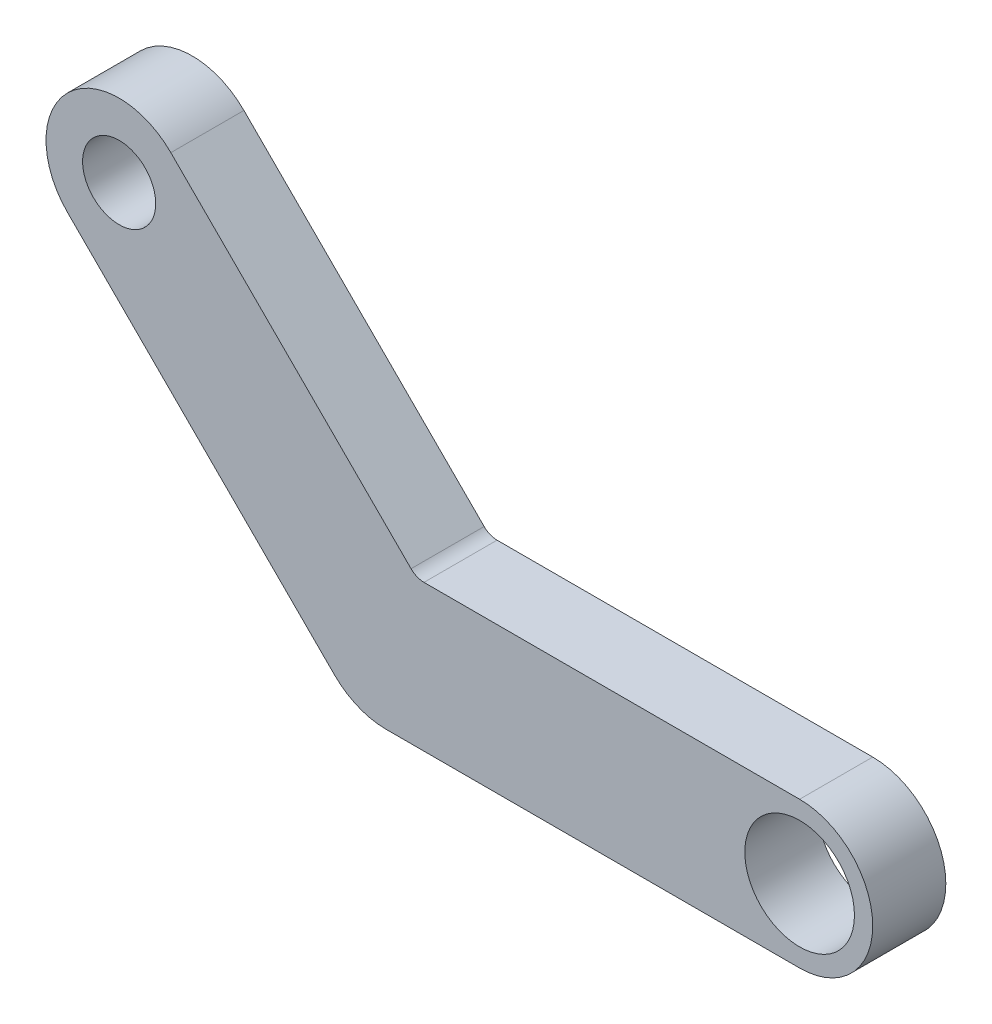
ISO-10303-21;
HEADER;
FILE_DESCRIPTION(('STEP AP214'),'2;1');
FILE_NAME('part.step','',(''),(''),'','','');
FILE_SCHEMA(('AUTOMOTIVE_DESIGN { 1 0 10303 214 1 1 1 1 }'));
ENDSEC;
DATA;
#1=APPLICATION_CONTEXT('core data for automotive mechanical design processes');
#2=APPLICATION_PROTOCOL_DEFINITION('international standard','automotive_design',2000,#1);
#3=PRODUCT_CONTEXT('',#1,'mechanical');
#4=PRODUCT('Part','Part','',(#3));
#5=PRODUCT_RELATED_PRODUCT_CATEGORY('part','',(#4));
#6=PRODUCT_DEFINITION_FORMATION('','',#4);
#7=PRODUCT_DEFINITION_CONTEXT('part definition',#1,'design');
#8=PRODUCT_DEFINITION('design','',#6,#7);
#9=PRODUCT_DEFINITION_SHAPE('','',#8);
#10=(LENGTH_UNIT() NAMED_UNIT(*) SI_UNIT(.MILLI.,.METRE.));
#11=(NAMED_UNIT(*) PLANE_ANGLE_UNIT() SI_UNIT($,.RADIAN.));
#12=(NAMED_UNIT(*) SI_UNIT($,.STERADIAN.) SOLID_ANGLE_UNIT());
#13=UNCERTAINTY_MEASURE_WITH_UNIT(LENGTH_MEASURE(1.E-05),#10,'distance_accuracy_value','');
#14=(GEOMETRIC_REPRESENTATION_CONTEXT(3) GLOBAL_UNCERTAINTY_ASSIGNED_CONTEXT((#13)) GLOBAL_UNIT_ASSIGNED_CONTEXT((#10,
#11,#12)) REPRESENTATION_CONTEXT('',''));
#15=CARTESIAN_POINT('',(0.,0.,0.));
#16=DIRECTION('',(0.,0.,1.));
#17=DIRECTION('',(1.,0.,0.));
#18=AXIS2_PLACEMENT_3D('',#15,#16,#17);
#19=CARTESIAN_POINT('',(-0.707106781186549,-0.707106781186546,1.));
#20=DIRECTION('',(0.707106781186549,0.707106781186546,0.));
#21=DIRECTION('',(-0.707106781186546,0.707106781186549,0.));
#22=AXIS2_PLACEMENT_3D('',#19,#20,#21);
#23=PLANE('',#22);
#24=DIRECTION('',(0.707106781186546,-0.707106781186549,0.));
#25=VECTOR('',#24,1.);
#26=CARTESIAN_POINT('',(-0.707106781186549,-0.707106781186546,0.));
#27=LINE('',#26,#25);
#28=CARTESIAN_POINT('',(-4.35942035448363,2.94520679211055,0.));
#29=VERTEX_POINT('',#28);
#30=CARTESIAN_POINT('',(-0.707106781186549,-0.707106781186546,0.));
#31=VERTEX_POINT('',#30);
#32=EDGE_CURVE('E137',#29,#31,#27,.T.);
#33=ORIENTED_EDGE('',*,*,#32,.T.);
#34=DIRECTION('',(0.,0.,-1.));
#35=VECTOR('',#34,1.);
#36=CARTESIAN_POINT('',(-0.707106781186549,-0.707106781186546,1.));
#37=LINE('',#36,#35);
#38=CARTESIAN_POINT('',(-0.707106781186549,-0.707106781186546,1.));
#39=VERTEX_POINT('',#38);
#40=EDGE_CURVE('E11',#39,#31,#37,.T.);
#41=ORIENTED_EDGE('',*,*,#40,.F.);
#42=DIRECTION('',(0.707106781186546,-0.707106781186549,0.));
#43=VECTOR('',#42,1.);
#44=CARTESIAN_POINT('',(-0.707106781186549,-0.707106781186546,1.));
#45=LINE('',#44,#43);
#46=CARTESIAN_POINT('',(-4.35942035448363,2.94520679211055,1.));
#47=VERTEX_POINT('',#46);
#48=EDGE_CURVE('E160',#47,#39,#45,.T.);
#49=ORIENTED_EDGE('',*,*,#48,.F.);
#50=DIRECTION('',(0.,0.,-1.));
#51=VECTOR('',#50,1.);
#52=CARTESIAN_POINT('',(-4.35942035448363,2.94520679211055,1.));
#53=LINE('',#52,#51);
#54=EDGE_CURVE('E136',#47,#29,#53,.T.);
#55=ORIENTED_EDGE('',*,*,#54,.T.);
#56=EDGE_LOOP('',(#33,#41,#49,#55));
#57=FACE_BOUND('',#56,.T.);
#58=ADVANCED_FACE('F36',(#57),#23,.F.);
#59=CARTESIAN_POINT('',(0.,0.,1.));
#60=DIRECTION('',(0.,0.,-1.));
#61=DIRECTION('',(-1.,0.,0.));
#62=AXIS2_PLACEMENT_3D('',#59,#60,#61);
#63=CYLINDRICAL_SURFACE('',#62,1.);
#64=CARTESIAN_POINT('',(0.,0.,0.));
#65=DIRECTION('',(0.,0.,1.));
#66=DIRECTION('',(1.,0.,0.));
#67=AXIS2_PLACEMENT_3D('',#64,#65,#66);
#68=CIRCLE('',#67,1.);
#69=CARTESIAN_POINT('',(0.,-1.,0.));
#70=VERTEX_POINT('',#69);
#71=EDGE_CURVE('E140',#31,#70,#68,.T.);
#72=ORIENTED_EDGE('',*,*,#71,.T.);
#73=DIRECTION('',(0.,0.,-1.));
#74=VECTOR('',#73,1.);
#75=CARTESIAN_POINT('',(0.,-1.,1.));
#76=LINE('',#75,#74);
#77=CARTESIAN_POINT('',(0.,-1.,1.));
#78=VERTEX_POINT('',#77);
#79=EDGE_CURVE('E44',#78,#70,#76,.T.);
#80=ORIENTED_EDGE('',*,*,#79,.F.);
#81=CARTESIAN_POINT('',(0.,0.,1.));
#82=DIRECTION('',(0.,0.,1.));
#83=DIRECTION('',(1.,0.,0.));
#84=AXIS2_PLACEMENT_3D('',#81,#82,#83);
#85=CIRCLE('',#84,1.);
#86=EDGE_CURVE('E91',#39,#78,#85,.T.);
#87=ORIENTED_EDGE('',*,*,#86,.F.);
#88=ORIENTED_EDGE('',*,*,#40,.T.);
#89=EDGE_LOOP('',(#72,#80,#87,#88));
#90=FACE_BOUND('',#89,.T.);
#91=ADVANCED_FACE('F193',(#90),#63,.T.);
#92=CARTESIAN_POINT('',(0.,-1.,1.));
#93=DIRECTION('',(0.,1.,0.));
#94=DIRECTION('',(0.,0.,1.));
#95=AXIS2_PLACEMENT_3D('',#92,#93,#94);
#96=PLANE('',#95);
#97=DIRECTION('',(1.,0.,0.));
#98=VECTOR('',#97,1.);
#99=CARTESIAN_POINT('',(0.,-1.,0.));
#100=LINE('',#99,#98);
#101=CARTESIAN_POINT('',(5.65685425,-1.,0.));
#102=VERTEX_POINT('',#101);
#103=EDGE_CURVE('E142',#70,#102,#100,.T.);
#104=ORIENTED_EDGE('',*,*,#103,.T.);
#105=DIRECTION('',(0.,0.,-1.));
#106=VECTOR('',#105,1.);
#107=CARTESIAN_POINT('',(5.65685425,-1.,1.));
#108=LINE('',#107,#106);
#109=CARTESIAN_POINT('',(5.65685425,-1.,1.));
#110=VERTEX_POINT('',#109);
#111=EDGE_CURVE('E166',#110,#102,#108,.T.);
#112=ORIENTED_EDGE('',*,*,#111,.F.);
#113=DIRECTION('',(1.,0.,0.));
#114=VECTOR('',#113,1.);
#115=CARTESIAN_POINT('',(0.,-1.,1.));
#116=LINE('',#115,#114);
#117=EDGE_CURVE('E174',#78,#110,#116,.T.);
#118=ORIENTED_EDGE('',*,*,#117,.F.);
#119=ORIENTED_EDGE('',*,*,#79,.T.);
#120=EDGE_LOOP('',(#104,#112,#118,#119));
#121=FACE_BOUND('',#120,.T.);
#122=ADVANCED_FACE('F172',(#121),#96,.F.);
#123=CARTESIAN_POINT('',(5.65685425,0.,1.));
#124=DIRECTION('',(0.,0.,-1.));
#125=DIRECTION('',(-1.,0.,0.));
#126=AXIS2_PLACEMENT_3D('',#123,#124,#125);
#127=CYLINDRICAL_SURFACE('',#126,1.);
#128=CARTESIAN_POINT('',(5.65685425,0.,0.));
#129=DIRECTION('',(0.,0.,1.));
#130=DIRECTION('',(1.,0.,0.));
#131=AXIS2_PLACEMENT_3D('',#128,#129,#130);
#132=CIRCLE('',#131,1.);
#133=CARTESIAN_POINT('',(5.65685425,1.,0.));
#134=VERTEX_POINT('',#133);
#135=EDGE_CURVE('E144',#102,#134,#132,.T.);
#136=ORIENTED_EDGE('',*,*,#135,.T.);
#137=DIRECTION('',(0.,0.,-1.));
#138=VECTOR('',#137,1.);
#139=CARTESIAN_POINT('',(5.65685425,1.,1.));
#140=LINE('',#139,#138);
#141=CARTESIAN_POINT('',(5.65685425,1.,1.));
#142=VERTEX_POINT('',#141);
#143=EDGE_CURVE('E164',#142,#134,#140,.T.);
#144=ORIENTED_EDGE('',*,*,#143,.F.);
#145=CARTESIAN_POINT('',(5.65685425,0.,1.));
#146=DIRECTION('',(0.,0.,1.));
#147=DIRECTION('',(1.,0.,0.));
#148=AXIS2_PLACEMENT_3D('',#145,#146,#147);
#149=CIRCLE('',#148,1.);
#150=EDGE_CURVE('E185',#110,#142,#149,.T.);
#151=ORIENTED_EDGE('',*,*,#150,.F.);
#152=ORIENTED_EDGE('',*,*,#111,.T.);
#153=EDGE_LOOP('',(#136,#144,#151,#152));
#154=FACE_BOUND('',#153,.T.);
#155=ADVANCED_FACE('F183',(#154),#127,.T.);
#156=CARTESIAN_POINT('',(0.,1.,1.));
#157=DIRECTION('',(0.,1.,0.));
#158=DIRECTION('',(-1.,0.,0.));
#159=AXIS2_PLACEMENT_3D('',#156,#157,#158);
#160=PLANE('',#159);
#161=DIRECTION('',(1.,0.,0.));
#162=VECTOR('',#161,1.);
#163=CARTESIAN_POINT('',(0.,1.,0.));
#164=LINE('',#163,#162);
#165=CARTESIAN_POINT('',(0.517766952966365,1.,0.));
#166=VERTEX_POINT('',#165);
#167=EDGE_CURVE('E147',#166,#134,#164,.T.);
#168=ORIENTED_EDGE('',*,*,#167,.F.);
#169=DIRECTION('',(0.,0.,-1.));
#170=VECTOR('',#169,1.);
#171=CARTESIAN_POINT('',(0.517766952966365,1.,1.));
#172=LINE('',#171,#170);
#173=CARTESIAN_POINT('',(0.517766952966365,1.,1.));
#174=VERTEX_POINT('',#173);
#175=EDGE_CURVE('E123',#174,#166,#172,.T.);
#176=ORIENTED_EDGE('',*,*,#175,.F.);
#177=DIRECTION('',(1.,0.,0.));
#178=VECTOR('',#177,1.);
#179=CARTESIAN_POINT('',(0.,1.,1.));
#180=LINE('',#179,#178);
#181=EDGE_CURVE('E112',#174,#142,#180,.T.);
#182=ORIENTED_EDGE('',*,*,#181,.T.);
#183=ORIENTED_EDGE('',*,*,#143,.T.);
#184=EDGE_LOOP('',(#168,#176,#182,#183));
#185=FACE_BOUND('',#184,.T.);
#186=ADVANCED_FACE('F203',(#185),#160,.T.);
#187=CARTESIAN_POINT('',(0.517766952966368,1.25,1.));
#188=DIRECTION('',(0.,0.,-1.));
#189=DIRECTION('',(-1.,0.,0.));
#190=AXIS2_PLACEMENT_3D('',#187,#188,#189);
#191=CYLINDRICAL_SURFACE('',#190,0.250000000000001);
#192=CARTESIAN_POINT('',(0.517766952966368,1.25,0.));
#193=DIRECTION('',(0.,0.,1.));
#194=DIRECTION('',(1.,0.,0.));
#195=AXIS2_PLACEMENT_3D('',#192,#193,#194);
#196=CIRCLE('',#195,0.250000000000001);
#197=CARTESIAN_POINT('',(0.340990257669728,1.07322330470336,0.));
#198=VERTEX_POINT('',#197);
#199=EDGE_CURVE('E119',#166,#198,#196,.F.);
#200=ORIENTED_EDGE('',*,*,#199,.T.);
#201=DIRECTION('',(0.,0.,-1.));
#202=VECTOR('',#201,1.);
#203=CARTESIAN_POINT('',(0.340990257669728,1.07322330470336,1.));
#204=LINE('',#203,#202);
#205=CARTESIAN_POINT('',(0.340990257669728,1.07322330470336,1.));
#206=VERTEX_POINT('',#205);
#207=EDGE_CURVE('E116',#206,#198,#204,.T.);
#208=ORIENTED_EDGE('',*,*,#207,.F.);
#209=CARTESIAN_POINT('',(0.517766952966368,1.25,1.));
#210=DIRECTION('',(0.,0.,1.));
#211=DIRECTION('',(1.,0.,0.));
#212=AXIS2_PLACEMENT_3D('',#209,#210,#211);
#213=CIRCLE('',#212,0.250000000000001);
#214=EDGE_CURVE('E105',#174,#206,#213,.F.);
#215=ORIENTED_EDGE('',*,*,#214,.F.);
#216=ORIENTED_EDGE('',*,*,#175,.T.);
#217=EDGE_LOOP('',(#200,#208,#215,#216));
#218=FACE_BOUND('',#217,.T.);
#219=ADVANCED_FACE('F117',(#218),#191,.F.);
#220=CARTESIAN_POINT('',(0.707106781186547,0.707106781186543,1.));
#221=DIRECTION('',(0.707106781186549,0.707106781186546,0.));
#222=DIRECTION('',(-0.707106781186546,0.707106781186549,0.));
#223=AXIS2_PLACEMENT_3D('',#220,#221,#222);
#224=PLANE('',#223);
#225=DIRECTION('',(0.707106781186546,-0.707106781186549,0.));
#226=VECTOR('',#225,1.);
#227=CARTESIAN_POINT('',(0.707106781186547,0.707106781186543,0.));
#228=LINE('',#227,#226);
#229=CARTESIAN_POINT('',(-2.94520679211054,4.35942035448364,0.));
#230=VERTEX_POINT('',#229);
#231=EDGE_CURVE('E151',#230,#198,#228,.T.);
#232=ORIENTED_EDGE('',*,*,#231,.F.);
#233=DIRECTION('',(0.,0.,-1.));
#234=VECTOR('',#233,1.);
#235=CARTESIAN_POINT('',(-2.94520679211054,4.35942035448364,1.));
#236=LINE('',#235,#234);
#237=CARTESIAN_POINT('',(-2.94520679211054,4.35942035448364,1.));
#238=VERTEX_POINT('',#237);
#239=EDGE_CURVE('E80',#238,#230,#236,.T.);
#240=ORIENTED_EDGE('',*,*,#239,.F.);
#241=DIRECTION('',(0.707106781186546,-0.707106781186549,0.));
#242=VECTOR('',#241,1.);
#243=CARTESIAN_POINT('',(0.707106781186547,0.707106781186543,1.));
#244=LINE('',#243,#242);
#245=EDGE_CURVE('E110',#238,#206,#244,.T.);
#246=ORIENTED_EDGE('',*,*,#245,.T.);
#247=ORIENTED_EDGE('',*,*,#207,.T.);
#248=EDGE_LOOP('',(#232,#240,#246,#247));
#249=FACE_BOUND('',#248,.T.);
#250=ADVANCED_FACE('F125',(#249),#224,.T.);
#251=CARTESIAN_POINT('',(5.65685425,0.,1.));
#252=DIRECTION('',(0.,0.,-1.));
#253=DIRECTION('',(-1.,0.,0.));
#254=AXIS2_PLACEMENT_3D('',#251,#252,#253);
#255=CYLINDRICAL_SURFACE('',#254,0.749999999999998);
#256=CARTESIAN_POINT('',(5.65685425,0.,1.));
#257=DIRECTION('',(0.,0.,1.));
#258=DIRECTION('',(1.,0.,0.));
#259=AXIS2_PLACEMENT_3D('',#256,#257,#258);
#260=CIRCLE('',#259,0.749999999999998);
#261=CARTESIAN_POINT('',(6.40685425,0.,1.));
#262=VERTEX_POINT('',#261);
#263=EDGE_CURVE('E127',#262,#262,#260,.T.);
#264=ORIENTED_EDGE('',*,*,#263,.T.);
#265=EDGE_LOOP('',(#264));
#266=FACE_BOUND('',#265,.T.);
#267=CARTESIAN_POINT('',(5.65685425,0.,0.));
#268=DIRECTION('',(0.,0.,1.));
#269=DIRECTION('',(1.,0.,0.));
#270=AXIS2_PLACEMENT_3D('',#267,#268,#269);
#271=CIRCLE('',#270,0.749999999999998);
#272=CARTESIAN_POINT('',(6.40685425,0.,0.));
#273=VERTEX_POINT('',#272);
#274=EDGE_CURVE('E154',#273,#273,#271,.T.);
#275=ORIENTED_EDGE('',*,*,#274,.F.);
#276=EDGE_LOOP('',(#275));
#277=FACE_BOUND('',#276,.T.);
#278=ADVANCED_FACE('F211',(#266,#277),#255,.F.);
#279=CARTESIAN_POINT('',(-3.65231357329708,3.6523135732971,1.));
#280=DIRECTION('',(0.,0.,-1.));
#281=DIRECTION('',(-1.,0.,0.));
#282=AXIS2_PLACEMENT_3D('',#279,#280,#281);
#283=CYLINDRICAL_SURFACE('',#282,0.999999999999998);
#284=CARTESIAN_POINT('',(-3.65231357329708,3.6523135732971,0.));
#285=DIRECTION('',(0.,0.,1.));
#286=DIRECTION('',(1.,0.,0.));
#287=AXIS2_PLACEMENT_3D('',#284,#285,#286);
#288=CIRCLE('',#287,0.999999999999998);
#289=EDGE_CURVE('E83',#230,#29,#288,.T.);
#290=ORIENTED_EDGE('',*,*,#289,.T.);
#291=ORIENTED_EDGE('',*,*,#54,.F.);
#292=CARTESIAN_POINT('',(-3.65231357329708,3.6523135732971,1.));
#293=DIRECTION('',(0.,0.,1.));
#294=DIRECTION('',(1.,0.,0.));
#295=AXIS2_PLACEMENT_3D('',#292,#293,#294);
#296=CIRCLE('',#295,0.999999999999998);
#297=EDGE_CURVE('E52',#238,#47,#296,.T.);
#298=ORIENTED_EDGE('',*,*,#297,.F.);
#299=ORIENTED_EDGE('',*,*,#239,.T.);
#300=EDGE_LOOP('',(#290,#291,#298,#299));
#301=FACE_BOUND('',#300,.T.);
#302=ADVANCED_FACE('F212',(#301),#283,.T.);
#303=CARTESIAN_POINT('',(-3.65231357329708,3.6523135732971,1.));
#304=DIRECTION('',(0.,0.,-1.));
#305=DIRECTION('',(-1.,0.,0.));
#306=AXIS2_PLACEMENT_3D('',#303,#304,#305);
#307=CYLINDRICAL_SURFACE('',#306,0.500000000000002);
#308=CARTESIAN_POINT('',(-3.65231357329708,3.6523135732971,1.));
#309=DIRECTION('',(0.,0.,1.));
#310=DIRECTION('',(1.,0.,0.));
#311=AXIS2_PLACEMENT_3D('',#308,#309,#310);
#312=CIRCLE('',#311,0.500000000000002);
#313=CARTESIAN_POINT('',(-3.15231357329708,3.6523135732971,1.));
#314=VERTEX_POINT('',#313);
#315=EDGE_CURVE('E133',#314,#314,#312,.T.);
#316=ORIENTED_EDGE('',*,*,#315,.T.);
#317=EDGE_LOOP('',(#316));
#318=FACE_BOUND('',#317,.T.);
#319=CARTESIAN_POINT('',(-3.65231357329708,3.6523135732971,0.));
#320=DIRECTION('',(0.,0.,1.));
#321=DIRECTION('',(1.,0.,0.));
#322=AXIS2_PLACEMENT_3D('',#319,#320,#321);
#323=CIRCLE('',#322,0.500000000000002);
#324=CARTESIAN_POINT('',(-3.15231357329708,3.6523135732971,0.));
#325=VERTEX_POINT('',#324);
#326=EDGE_CURVE('E157',#325,#325,#323,.T.);
#327=ORIENTED_EDGE('',*,*,#326,.F.);
#328=EDGE_LOOP('',(#327));
#329=FACE_BOUND('',#328,.T.);
#330=ADVANCED_FACE('F215',(#318,#329),#307,.F.);
#331=CARTESIAN_POINT('',(0.,0.,1.));
#332=DIRECTION('',(0.,0.,1.));
#333=DIRECTION('',(1.,0.,0.));
#334=AXIS2_PLACEMENT_3D('',#331,#332,#333);
#335=PLANE('',#334);
#336=ORIENTED_EDGE('',*,*,#48,.T.);
#337=ORIENTED_EDGE('',*,*,#86,.T.);
#338=ORIENTED_EDGE('',*,*,#117,.T.);
#339=ORIENTED_EDGE('',*,*,#150,.T.);
#340=ORIENTED_EDGE('',*,*,#181,.F.);
#341=ORIENTED_EDGE('',*,*,#214,.T.);
#342=ORIENTED_EDGE('',*,*,#245,.F.);
#343=ORIENTED_EDGE('',*,*,#297,.T.);
#344=EDGE_LOOP('',(#336,#337,#338,#339,#340,#341,#342,#343));
#345=FACE_BOUND('',#344,.T.);
#346=ORIENTED_EDGE('',*,*,#263,.F.);
#347=EDGE_LOOP('',(#346));
#348=FACE_BOUND('',#347,.T.);
#349=ORIENTED_EDGE('',*,*,#315,.F.);
#350=EDGE_LOOP('',(#349));
#351=FACE_BOUND('',#350,.T.);
#352=ADVANCED_FACE('F107',(#345,#348,#351),#335,.T.);
#353=CARTESIAN_POINT('',(0.,0.,0.));
#354=DIRECTION('',(0.,0.,1.));
#355=DIRECTION('',(1.,0.,0.));
#356=AXIS2_PLACEMENT_3D('',#353,#354,#355);
#357=PLANE('',#356);
#358=ORIENTED_EDGE('',*,*,#32,.F.);
#359=ORIENTED_EDGE('',*,*,#289,.F.);
#360=ORIENTED_EDGE('',*,*,#231,.T.);
#361=ORIENTED_EDGE('',*,*,#199,.F.);
#362=ORIENTED_EDGE('',*,*,#167,.T.);
#363=ORIENTED_EDGE('',*,*,#135,.F.);
#364=ORIENTED_EDGE('',*,*,#103,.F.);
#365=ORIENTED_EDGE('',*,*,#71,.F.);
#366=EDGE_LOOP('',(#358,#359,#360,#361,#362,#363,#364,#365));
#367=FACE_BOUND('',#366,.T.);
#368=ORIENTED_EDGE('',*,*,#274,.T.);
#369=EDGE_LOOP('',(#368));
#370=FACE_BOUND('',#369,.T.);
#371=ORIENTED_EDGE('',*,*,#326,.T.);
#372=EDGE_LOOP('',(#371));
#373=FACE_BOUND('',#372,.T.);
#374=ADVANCED_FACE('F178',(#367,#370,#373),#357,.F.);
#375=CLOSED_SHELL('',(#58,#91,#122,#155,#186,#219,#250,#278,#302,#330,#352,#374));
#376=MANIFOLD_SOLID_BREP('B2',#375);
#377=ADVANCED_BREP_SHAPE_REPRESENTATION('',(#18,#376),#14);
#378=SHAPE_DEFINITION_REPRESENTATION(#9,#377);
ENDSEC;
END-ISO-10303-21;
